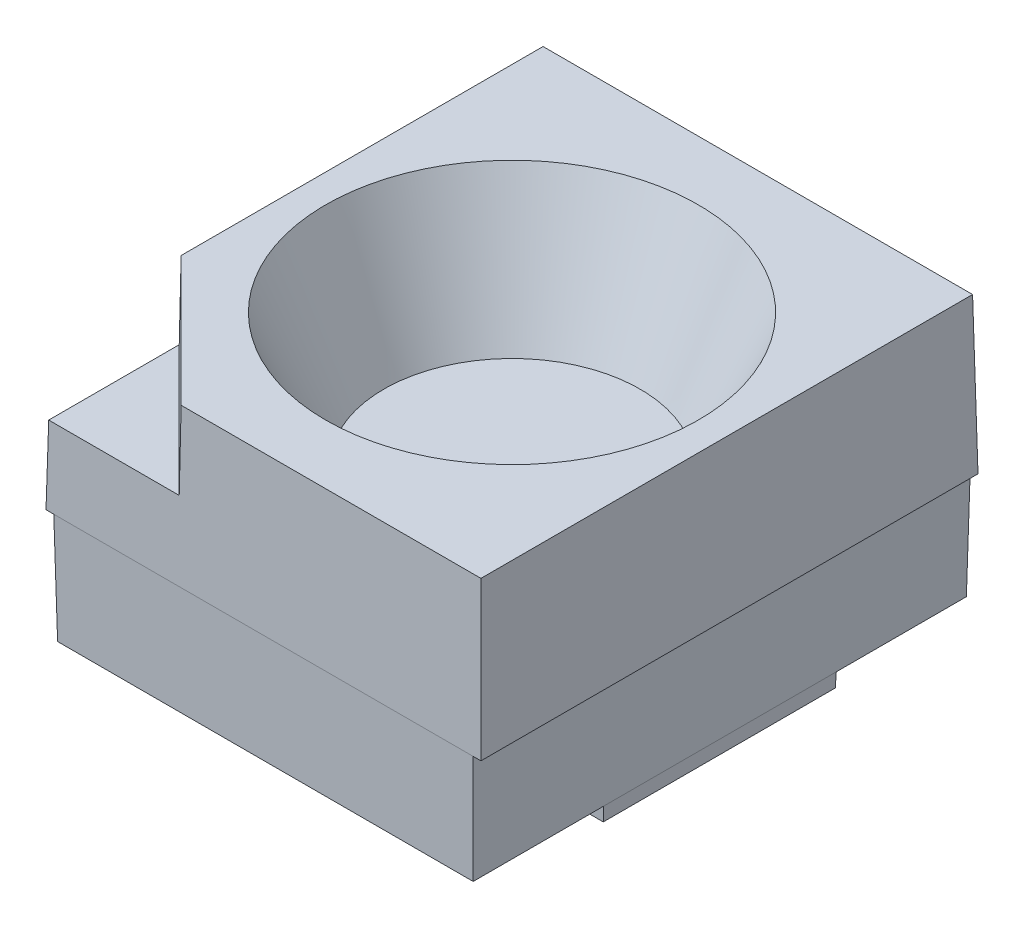
ISO-10303-21;
HEADER;
FILE_DESCRIPTION(('STEP AP214'),'2;1');
FILE_NAME('part.step','',(''),(''),'','','');
FILE_SCHEMA(('AUTOMOTIVE_DESIGN { 1 0 10303 214 1 1 1 1 }'));
ENDSEC;
DATA;
#1=APPLICATION_CONTEXT('core data for automotive mechanical design processes');
#2=APPLICATION_PROTOCOL_DEFINITION('international standard','automotive_design',2000,#1);
#3=PRODUCT_CONTEXT('',#1,'mechanical');
#4=PRODUCT('Part','Part','',(#3));
#5=PRODUCT_RELATED_PRODUCT_CATEGORY('part','',(#4));
#6=PRODUCT_DEFINITION_FORMATION('','',#4);
#7=PRODUCT_DEFINITION_CONTEXT('part definition',#1,'design');
#8=PRODUCT_DEFINITION('design','',#6,#7);
#9=PRODUCT_DEFINITION_SHAPE('','',#8);
#10=(LENGTH_UNIT() NAMED_UNIT(*) SI_UNIT(.MILLI.,.METRE.));
#11=(NAMED_UNIT(*) PLANE_ANGLE_UNIT() SI_UNIT($,.RADIAN.));
#12=(NAMED_UNIT(*) SI_UNIT($,.STERADIAN.) SOLID_ANGLE_UNIT());
#13=UNCERTAINTY_MEASURE_WITH_UNIT(LENGTH_MEASURE(1.E-05),#10,'distance_accuracy_value','');
#14=(GEOMETRIC_REPRESENTATION_CONTEXT(3) GLOBAL_UNCERTAINTY_ASSIGNED_CONTEXT((#13)) GLOBAL_UNIT_ASSIGNED_CONTEXT((#10,
#11,#12)) REPRESENTATION_CONTEXT('',''));
#15=CARTESIAN_POINT('',(0.,0.,0.));
#16=DIRECTION('',(0.,0.,1.));
#17=DIRECTION('',(1.,0.,0.));
#18=AXIS2_PLACEMENT_3D('',#15,#16,#17);
#19=CARTESIAN_POINT('',(0.,0.26,0.));
#20=DIRECTION('',(0.,1.,0.));
#21=DIRECTION('',(0.,0.,1.));
#22=AXIS2_PLACEMENT_3D('',#19,#20,#21);
#23=PLANE('',#22);
#24=CARTESIAN_POINT('',(0.,0.26,0.));
#25=DIRECTION('',(0.,1.,0.));
#26=DIRECTION('',(0.,0.,1.));
#27=AXIS2_PLACEMENT_3D('',#24,#25,#26);
#28=CIRCLE('',#27,0.5);
#29=CARTESIAN_POINT('',(0.,0.26,0.5));
#30=VERTEX_POINT('',#29);
#31=EDGE_CURVE('E20',#30,#30,#28,.F.);
#32=ORIENTED_EDGE('',*,*,#31,.T.);
#33=EDGE_LOOP('',(#32));
#34=FACE_BOUND('',#33,.T.);
#35=ADVANCED_FACE('F17',(#34),#23,.F.);
#36=CARTESIAN_POINT('',(0.,0.155,0.));
#37=DIRECTION('',(0.,1.,0.));
#38=DIRECTION('',(0.,0.,1.));
#39=AXIS2_PLACEMENT_3D('',#36,#37,#38);
#40=CYLINDRICAL_SURFACE('',#39,0.5);
#41=ORIENTED_EDGE('',*,*,#31,.F.);
#42=EDGE_LOOP('',(#41));
#43=FACE_BOUND('',#42,.T.);
#44=CARTESIAN_POINT('',(0.,0.06,0.));
#45=DIRECTION('',(0.,1.,0.));
#46=DIRECTION('',(0.,0.,1.));
#47=AXIS2_PLACEMENT_3D('',#44,#45,#46);
#48=CIRCLE('',#47,0.5);
#49=CARTESIAN_POINT('',(0.,0.0599999999999999,0.5));
#50=VERTEX_POINT('',#49);
#51=EDGE_CURVE('E148',#50,#50,#48,.F.);
#52=ORIENTED_EDGE('',*,*,#51,.T.);
#53=EDGE_LOOP('',(#52));
#54=FACE_BOUND('',#53,.T.);
#55=ADVANCED_FACE('F164',(#43,#54),#40,.F.);
#56=CARTESIAN_POINT('',(0.,0.06,0.));
#57=DIRECTION('',(0.,1.,0.));
#58=DIRECTION('',(0.,0.,1.));
#59=AXIS2_PLACEMENT_3D('',#56,#57,#58);
#60=PLANE('',#59);
#61=DIRECTION('',(1.,0.,0.));
#62=VECTOR('',#61,1.);
#63=CARTESIAN_POINT('',(-1.3376069,0.06,0.746857130745743));
#64=LINE('',#63,#62);
#65=CARTESIAN_POINT('',(-1.33446403074574,0.06,0.746857130745743));
#66=VERTEX_POINT('',#65);
#67=CARTESIAN_POINT('',(1.33446403074574,0.06,0.746857130745743));
#68=VERTEX_POINT('',#67);
#69=EDGE_CURVE('E123',#66,#68,#64,.T.);
#70=ORIENTED_EDGE('',*,*,#69,.F.);
#71=DIRECTION('',(0.,0.,1.));
#72=VECTOR('',#71,1.);
#73=CARTESIAN_POINT('',(-1.33446403074574,0.06,0.));
#74=LINE('',#73,#72);
#75=CARTESIAN_POINT('',(-1.33446403074574,0.06,-0.746857130745743));
#76=VERTEX_POINT('',#75);
#77=EDGE_CURVE('E135',#76,#66,#74,.T.);
#78=ORIENTED_EDGE('',*,*,#77,.F.);
#79=DIRECTION('',(1.,0.,0.));
#80=VECTOR('',#79,1.);
#81=CARTESIAN_POINT('',(1.3376069,0.06,-0.746857130745743));
#82=LINE('',#81,#80);
#83=CARTESIAN_POINT('',(1.33446403074574,0.06,-0.746857130745743));
#84=VERTEX_POINT('',#83);
#85=EDGE_CURVE('E116',#84,#76,#82,.F.);
#86=ORIENTED_EDGE('',*,*,#85,.F.);
#87=DIRECTION('',(0.,0.,1.));
#88=VECTOR('',#87,1.);
#89=CARTESIAN_POINT('',(1.33446403074574,0.0599999999999999,0.75));
#90=LINE('',#89,#88);
#91=EDGE_CURVE('E119',#68,#84,#90,.F.);
#92=ORIENTED_EDGE('',*,*,#91,.F.);
#93=EDGE_LOOP('',(#70,#78,#86,#92));
#94=FACE_BOUND('',#93,.T.);
#95=ORIENTED_EDGE('',*,*,#51,.F.);
#96=EDGE_LOOP('',(#95));
#97=FACE_BOUND('',#96,.T.);
#98=ADVANCED_FACE('F121',(#94,#97),#60,.F.);
#99=CARTESIAN_POINT('',(-1.3376069,0.15,0.75));
#100=DIRECTION('',(0.,-0.0348994967025014,0.999390827019096));
#101=DIRECTION('',(0.,-0.999390827019096,-0.0348994967025014));
#102=AXIS2_PLACEMENT_3D('',#99,#100,#101);
#103=PLANE('',#102);
#104=DIRECTION('',(1.,0.,0.));
#105=VECTOR('',#104,1.);
#106=CARTESIAN_POINT('',(0.,0.15,0.74999999999974));
#107=LINE('',#106,#105);
#108=CARTESIAN_POINT('',(1.33760690255998,0.149999999994684,0.749999999999554));
#109=VERTEX_POINT('',#108);
#110=CARTESIAN_POINT('',(-1.33760690099034,0.14999999999003,0.749999999999768));
#111=VERTEX_POINT('',#110);
#112=EDGE_CURVE('E429',#109,#111,#107,.F.);
#113=ORIENTED_EDGE('',*,*,#112,.T.);
#114=DIRECTION('',(-0.0348782627423816,0.998782765958977,0.034878262734965));
#115=VECTOR('',#114,1.);
#116=CARTESIAN_POINT('',(-1.33446403074574,0.0599999999999999,0.746857130745743));
#117=LINE('',#116,#115);
#118=EDGE_CURVE('E134',#66,#111,#117,.T.);
#119=ORIENTED_EDGE('',*,*,#118,.F.);
#120=ORIENTED_EDGE('',*,*,#69,.T.);
#121=DIRECTION('',(-0.0348782627424097,-0.998782765959737,-0.0348782627131562));
#122=VECTOR('',#121,1.);
#123=CARTESIAN_POINT('',(1.33760690000238,0.150000000068034,0.74999999999974));
#124=LINE('',#123,#122);
#125=EDGE_CURVE('E128',#109,#68,#124,.T.);
#126=ORIENTED_EDGE('',*,*,#125,.F.);
#127=EDGE_LOOP('',(#113,#119,#120,#126));
#128=FACE_BOUND('',#127,.T.);
#129=ADVANCED_FACE('F131',(#128),#103,.T.);
#130=CARTESIAN_POINT('',(1.3376069,0.15,0.75));
#131=DIRECTION('',(0.999390827019096,-0.0348994967025001,0.));
#132=DIRECTION('',(0.0348994967025001,0.999390827019096,0.));
#133=AXIS2_PLACEMENT_3D('',#130,#131,#132);
#134=PLANE('',#133);
#135=DIRECTION('',(0.,0.,1.));
#136=VECTOR('',#135,1.);
#137=CARTESIAN_POINT('',(1.3376069039003,0.149999999961715,1.6));
#138=LINE('',#137,#136);
#139=CARTESIAN_POINT('',(1.33760690089942,0.150000000005314,-0.749999999999787));
#140=VERTEX_POINT('',#139);
#141=EDGE_CURVE('E140',#109,#140,#138,.F.);
#142=ORIENTED_EDGE('',*,*,#141,.F.);
#143=ORIENTED_EDGE('',*,*,#125,.T.);
#144=ORIENTED_EDGE('',*,*,#91,.T.);
#145=DIRECTION('',(-0.0348782749061571,-0.998782765534467,0.0348782627275606));
#146=VECTOR('',#145,1.);
#147=CARTESIAN_POINT('',(1.33760690109711,0.149999999991498,-0.749999999999703));
#148=LINE('',#147,#146);
#149=EDGE_CURVE('E143',#140,#84,#148,.T.);
#150=ORIENTED_EDGE('',*,*,#149,.F.);
#151=EDGE_LOOP('',(#142,#143,#144,#150));
#152=FACE_BOUND('',#151,.T.);
#153=ADVANCED_FACE('F138',(#152),#134,.T.);
#154=CARTESIAN_POINT('',(1.3376069,0.15,-0.75));
#155=DIRECTION('',(0.,-0.0348994967025014,-0.999390827019096));
#156=DIRECTION('',(0.,0.999390827019096,-0.0348994967025014));
#157=AXIS2_PLACEMENT_3D('',#154,#155,#156);
#158=PLANE('',#157);
#159=DIRECTION('',(1.,0.,0.));
#160=VECTOR('',#159,1.);
#161=CARTESIAN_POINT('',(0.,0.15,-0.749999999999703));
#162=LINE('',#161,#160);
#163=CARTESIAN_POINT('',(-1.33760690255988,0.149999999992424,-0.749999999999466));
#164=VERTEX_POINT('',#163);
#165=EDGE_CURVE('E404',#164,#140,#162,.T.);
#166=ORIENTED_EDGE('',*,*,#165,.T.);
#167=ORIENTED_EDGE('',*,*,#149,.T.);
#168=ORIENTED_EDGE('',*,*,#85,.T.);
#169=DIRECTION('',(0.0348782627424078,-0.998782765959737,0.0348782627131579));
#170=VECTOR('',#169,1.);
#171=CARTESIAN_POINT('',(-1.33760690000234,0.150000000066971,-0.749999999999703));
#172=LINE('',#171,#170);
#173=EDGE_CURVE('E406',#164,#76,#172,.T.);
#174=ORIENTED_EDGE('',*,*,#173,.F.);
#175=EDGE_LOOP('',(#166,#167,#168,#174));
#176=FACE_BOUND('',#175,.T.);
#177=ADVANCED_FACE('F247',(#176),#158,.T.);
#178=CARTESIAN_POINT('',(-1.3376069,0.15,-0.75));
#179=DIRECTION('',(-0.999390827019096,-0.0348994967025001,0.));
#180=DIRECTION('',(0.0348994967025001,-0.999390827019096,0.));
#181=AXIS2_PLACEMENT_3D('',#178,#179,#180);
#182=PLANE('',#181);
#183=DIRECTION('',(0.,0.,1.));
#184=VECTOR('',#183,1.);
#185=CARTESIAN_POINT('',(-1.33760690390028,0.149999999960651,-1.6));
#186=LINE('',#185,#184);
#187=EDGE_CURVE('E433',#164,#111,#186,.T.);
#188=ORIENTED_EDGE('',*,*,#187,.F.);
#189=ORIENTED_EDGE('',*,*,#173,.T.);
#190=ORIENTED_EDGE('',*,*,#77,.T.);
#191=ORIENTED_EDGE('',*,*,#118,.T.);
#192=EDGE_LOOP('',(#188,#189,#190,#191));
#193=FACE_BOUND('',#192,.T.);
#194=ADVANCED_FACE('F243',(#193),#182,.T.);
#195=CARTESIAN_POINT('',(0.,0.15,0.));
#196=DIRECTION('',(0.,1.,0.));
#197=DIRECTION('',(0.,0.,1.));
#198=AXIS2_PLACEMENT_3D('',#195,#196,#197);
#199=PLANE('',#198);
#200=DIRECTION('',(0.,0.,1.));
#201=VECTOR('',#200,1.);
#202=CARTESIAN_POINT('',(-1.33760690389987,0.149999999937248,-1.6));
#203=LINE('',#202,#201);
#204=CARTESIAN_POINT('',(-1.33760690195,0.14999999997474,1.58760690390046));
#205=VERTEX_POINT('',#204);
#206=EDGE_CURVE('E419',#111,#205,#203,.T.);
#207=ORIENTED_EDGE('',*,*,#206,.F.);
#208=ORIENTED_EDGE('',*,*,#112,.F.);
#209=DIRECTION('',(0.,0.,1.));
#210=VECTOR('',#209,1.);
#211=CARTESIAN_POINT('',(1.33760690390089,0.149999999995746,1.6));
#212=LINE('',#211,#210);
#213=CARTESIAN_POINT('',(1.33760690390074,0.149999999989365,1.58760690390052));
#214=VERTEX_POINT('',#213);
#215=EDGE_CURVE('E415',#214,#109,#212,.F.);
#216=ORIENTED_EDGE('',*,*,#215,.F.);
#217=DIRECTION('',(1.,0.,0.));
#218=VECTOR('',#217,1.);
#219=CARTESIAN_POINT('',(-1.35,0.149999999961714,1.5876069039003));
#220=LINE('',#219,#218);
#221=EDGE_CURVE('E438',#205,#214,#220,.T.);
#222=ORIENTED_EDGE('',*,*,#221,.F.);
#223=EDGE_LOOP('',(#207,#208,#216,#222));
#224=FACE_BOUND('',#223,.T.);
#225=ADVANCED_FACE('F239',(#224),#199,.F.);
#226=CARTESIAN_POINT('',(1.35,0.86,1.6));
#227=DIRECTION('',(0.999847695156391,-0.0174524064372834,0.));
#228=DIRECTION('',(0.0174524064372834,0.999847695156391,0.));
#229=AXIS2_PLACEMENT_3D('',#226,#227,#228);
#230=PLANE('',#229);
#231=ORIENTED_EDGE('',*,*,#215,.T.);
#232=ORIENTED_EDGE('',*,*,#141,.T.);
#233=DIRECTION('',(0.,0.,1.));
#234=VECTOR('',#233,1.);
#235=CARTESIAN_POINT('',(1.33760690109711,0.15,0.));
#236=LINE('',#235,#234);
#237=CARTESIAN_POINT('',(1.33760690295549,0.149999999960648,-1.58760690390024));
#238=VERTEX_POINT('',#237);
#239=EDGE_CURVE('E409',#140,#238,#236,.F.);
#240=ORIENTED_EDGE('',*,*,#239,.T.);
#241=DIRECTION('',(0.0174497491606828,0.999695459881895,-0.0174497491602685));
#242=VECTOR('',#241,1.);
#243=CARTESIAN_POINT('',(1.33760690389993,0.149999999940437,-1.58760690390022));
#244=LINE('',#243,#242);
#245=CARTESIAN_POINT('',(1.35,0.86,-1.6));
#246=VERTEX_POINT('',#245);
#247=EDGE_CURVE('E427',#238,#246,#244,.T.);
#248=ORIENTED_EDGE('',*,*,#247,.T.);
#249=DIRECTION('',(0.,0.,1.));
#250=VECTOR('',#249,1.);
#251=CARTESIAN_POINT('',(1.35,0.86,0.));
#252=LINE('',#251,#250);
#253=CARTESIAN_POINT('',(1.35,0.86,1.6));
#254=VERTEX_POINT('',#253);
#255=EDGE_CURVE('E450',#246,#254,#252,.T.);
#256=ORIENTED_EDGE('',*,*,#255,.T.);
#257=DIRECTION('',(0.0174497491606842,0.999695459881887,0.0174497491606827));
#258=VECTOR('',#257,1.);
#259=CARTESIAN_POINT('',(1.33760690390089,0.149999999995743,1.58760690390089));
#260=LINE('',#259,#258);
#261=EDGE_CURVE('E441',#214,#254,#260,.T.);
#262=ORIENTED_EDGE('',*,*,#261,.F.);
#263=EDGE_LOOP('',(#231,#232,#240,#248,#256,#262));
#264=FACE_BOUND('',#263,.T.);
#265=ADVANCED_FACE('F235',(#264),#230,.T.);
#266=CARTESIAN_POINT('',(0.,0.15,0.));
#267=DIRECTION('',(0.,1.,0.));
#268=DIRECTION('',(0.,0.,1.));
#269=AXIS2_PLACEMENT_3D('',#266,#267,#268);
#270=PLANE('',#269);
#271=ORIENTED_EDGE('',*,*,#239,.F.);
#272=ORIENTED_EDGE('',*,*,#165,.F.);
#273=DIRECTION('',(0.,0.,1.));
#274=VECTOR('',#273,1.);
#275=CARTESIAN_POINT('',(-1.33760690390082,0.149999999991491,-1.6));
#276=LINE('',#275,#274);
#277=CARTESIAN_POINT('',(-1.33760690390067,0.149999999987237,-1.5876069039003));
#278=VERTEX_POINT('',#277);
#279=EDGE_CURVE('E422',#278,#164,#276,.T.);
#280=ORIENTED_EDGE('',*,*,#279,.F.);
#281=DIRECTION('',(1.,0.,0.));
#282=VECTOR('',#281,1.);
#283=CARTESIAN_POINT('',(1.35,0.149999999957456,-1.58760690390022));
#284=LINE('',#283,#282);
#285=EDGE_CURVE('E418',#238,#278,#284,.F.);
#286=ORIENTED_EDGE('',*,*,#285,.F.);
#287=EDGE_LOOP('',(#271,#272,#280,#286));
#288=FACE_BOUND('',#287,.T.);
#289=ADVANCED_FACE('F231',(#288),#270,.F.);
#290=CARTESIAN_POINT('',(-1.35,0.86,-1.6));
#291=DIRECTION('',(-0.999847695156391,-0.0174524064372834,0.));
#292=DIRECTION('',(0.0174524064372834,-0.999847695156391,0.));
#293=AXIS2_PLACEMENT_3D('',#290,#291,#292);
#294=PLANE('',#293);
#295=ORIENTED_EDGE('',*,*,#279,.T.);
#296=ORIENTED_EDGE('',*,*,#187,.T.);
#297=ORIENTED_EDGE('',*,*,#206,.T.);
#298=DIRECTION('',(0.0174497510482609,-0.99969545984895,-0.0174497491601077));
#299=VECTOR('',#298,1.);
#300=CARTESIAN_POINT('',(-1.35,0.86,1.6));
#301=LINE('',#300,#299);
#302=CARTESIAN_POINT('',(-1.35,0.86,1.6));
#303=VERTEX_POINT('',#302);
#304=EDGE_CURVE('E446',#303,#205,#301,.T.);
#305=ORIENTED_EDGE('',*,*,#304,.F.);
#306=DIRECTION('',(0.,0.,1.));
#307=VECTOR('',#306,1.);
#308=CARTESIAN_POINT('',(-1.35,0.86,0.));
#309=LINE('',#308,#307);
#310=CARTESIAN_POINT('',(-1.35,0.86,-1.6));
#311=VERTEX_POINT('',#310);
#312=EDGE_CURVE('E156',#303,#311,#309,.F.);
#313=ORIENTED_EDGE('',*,*,#312,.T.);
#314=DIRECTION('',(-0.0174497491606785,0.999695459881887,-0.0174497491606825));
#315=VECTOR('',#314,1.);
#316=CARTESIAN_POINT('',(-1.33760690390082,0.149999999991486,-1.58760690390082));
#317=LINE('',#316,#315);
#318=EDGE_CURVE('E453',#278,#311,#317,.T.);
#319=ORIENTED_EDGE('',*,*,#318,.F.);
#320=EDGE_LOOP('',(#295,#296,#297,#305,#313,#319));
#321=FACE_BOUND('',#320,.T.);
#322=ADVANCED_FACE('F227',(#321),#294,.T.);
#323=CARTESIAN_POINT('',(0.,1.02,0.));
#324=DIRECTION('',(0.,-1.,0.));
#325=DIRECTION('',(0.,0.,-1.));
#326=AXIS2_PLACEMENT_3D('',#323,#324,#325);
#327=PLANE('',#326);
#328=CARTESIAN_POINT('',(0.,1.0199999999827,0.));
#329=DIRECTION('',(0.,1.,0.));
#330=DIRECTION('',(0.,0.,1.));
#331=AXIS2_PLACEMENT_3D('',#328,#329,#330);
#332=CIRCLE('',#331,0.825000000014192);
#333=CARTESIAN_POINT('',(0.,1.0199999999827,0.825000000014192));
#334=VERTEX_POINT('',#333);
#335=EDGE_CURVE('E153',#334,#334,#332,.T.);
#336=ORIENTED_EDGE('',*,*,#335,.T.);
#337=EDGE_LOOP('',(#336));
#338=FACE_BOUND('',#337,.T.);
#339=ADVANCED_FACE('F223',(#338),#327,.F.);
#340=CARTESIAN_POINT('',(-1.35,0.86,1.6));
#341=DIRECTION('',(0.,-0.0174524064372834,0.999847695156391));
#342=DIRECTION('',(0.,-0.999847695156391,-0.0174524064372834));
#343=AXIS2_PLACEMENT_3D('',#340,#341,#342);
#344=PLANE('',#343);
#345=DIRECTION('',(1.,0.,0.));
#346=VECTOR('',#345,1.);
#347=CARTESIAN_POINT('',(1.4,0.86,1.6));
#348=LINE('',#347,#346);
#349=EDGE_CURVE('E155',#303,#254,#348,.T.);
#350=ORIENTED_EDGE('',*,*,#349,.F.);
#351=ORIENTED_EDGE('',*,*,#304,.T.);
#352=ORIENTED_EDGE('',*,*,#221,.T.);
#353=ORIENTED_EDGE('',*,*,#261,.T.);
#354=EDGE_LOOP('',(#350,#351,#352,#353));
#355=FACE_BOUND('',#354,.T.);
#356=ADVANCED_FACE('F219',(#355),#344,.T.);
#357=CARTESIAN_POINT('',(0.,0.86,0.));
#358=DIRECTION('',(0.,1.,0.));
#359=DIRECTION('',(0.,0.,1.));
#360=AXIS2_PLACEMENT_3D('',#357,#358,#359);
#361=PLANE('',#360);
#362=DIRECTION('',(1.,0.,0.));
#363=VECTOR('',#362,1.);
#364=CARTESIAN_POINT('',(1.4,0.86,1.6));
#365=LINE('',#364,#363);
#366=CARTESIAN_POINT('',(1.4,0.86,1.6));
#367=VERTEX_POINT('',#366);
#368=EDGE_CURVE('E459',#254,#367,#365,.T.);
#369=ORIENTED_EDGE('',*,*,#368,.F.);
#370=ORIENTED_EDGE('',*,*,#255,.F.);
#371=DIRECTION('',(1.,0.,0.));
#372=VECTOR('',#371,1.);
#373=CARTESIAN_POINT('',(0.,0.86,-1.6));
#374=LINE('',#373,#372);
#375=CARTESIAN_POINT('',(1.4,0.86,-1.6));
#376=VERTEX_POINT('',#375);
#377=EDGE_CURVE('E448',#376,#246,#374,.F.);
#378=ORIENTED_EDGE('',*,*,#377,.F.);
#379=DIRECTION('',(0.,0.,1.));
#380=VECTOR('',#379,1.);
#381=CARTESIAN_POINT('',(1.4,0.86,-1.6));
#382=LINE('',#381,#380);
#383=EDGE_CURVE('E469',#367,#376,#382,.F.);
#384=ORIENTED_EDGE('',*,*,#383,.F.);
#385=EDGE_LOOP('',(#369,#370,#378,#384));
#386=FACE_BOUND('',#385,.T.);
#387=ADVANCED_FACE('F215',(#386),#361,.F.);
#388=CARTESIAN_POINT('',(1.35,0.86,-1.6));
#389=DIRECTION('',(0.,-0.0174524064372834,-0.999847695156391));
#390=DIRECTION('',(0.,0.999847695156391,-0.0174524064372834));
#391=AXIS2_PLACEMENT_3D('',#388,#389,#390);
#392=PLANE('',#391);
#393=DIRECTION('',(1.,0.,0.));
#394=VECTOR('',#393,1.);
#395=CARTESIAN_POINT('',(-1.4,0.86,-1.6));
#396=LINE('',#395,#394);
#397=EDGE_CURVE('E472',#246,#311,#396,.F.);
#398=ORIENTED_EDGE('',*,*,#397,.F.);
#399=ORIENTED_EDGE('',*,*,#247,.F.);
#400=ORIENTED_EDGE('',*,*,#285,.T.);
#401=ORIENTED_EDGE('',*,*,#318,.T.);
#402=EDGE_LOOP('',(#398,#399,#400,#401));
#403=FACE_BOUND('',#402,.T.);
#404=ADVANCED_FACE('F211',(#403),#392,.T.);
#405=CARTESIAN_POINT('',(0.,0.86,0.));
#406=DIRECTION('',(0.,1.,0.));
#407=DIRECTION('',(0.,0.,1.));
#408=AXIS2_PLACEMENT_3D('',#405,#406,#407);
#409=PLANE('',#408);
#410=DIRECTION('',(1.,0.,0.));
#411=VECTOR('',#410,1.);
#412=CARTESIAN_POINT('',(-1.4,0.86,-1.6));
#413=LINE('',#412,#411);
#414=CARTESIAN_POINT('',(-1.4,0.86,-1.6));
#415=VERTEX_POINT('',#414);
#416=EDGE_CURVE('E475',#311,#415,#413,.F.);
#417=ORIENTED_EDGE('',*,*,#416,.F.);
#418=ORIENTED_EDGE('',*,*,#312,.F.);
#419=DIRECTION('',(1.,0.,0.));
#420=VECTOR('',#419,1.);
#421=CARTESIAN_POINT('',(1.4,0.86,1.6));
#422=LINE('',#421,#420);
#423=CARTESIAN_POINT('',(-1.4,0.86,1.6));
#424=VERTEX_POINT('',#423);
#425=EDGE_CURVE('E463',#424,#303,#422,.T.);
#426=ORIENTED_EDGE('',*,*,#425,.F.);
#427=DIRECTION('',(0.,0.,1.));
#428=VECTOR('',#427,1.);
#429=CARTESIAN_POINT('',(-1.4,0.86,1.6));
#430=LINE('',#429,#428);
#431=EDGE_CURVE('E483',#415,#424,#430,.T.);
#432=ORIENTED_EDGE('',*,*,#431,.F.);
#433=EDGE_LOOP('',(#417,#418,#426,#432));
#434=FACE_BOUND('',#433,.T.);
#435=ADVANCED_FACE('F207',(#434),#409,.F.);
#436=CARTESIAN_POINT('',(-1.09240855018385,1.36,1.29240855018385));
#437=DIRECTION('',(0.,1.,0.));
#438=DIRECTION('',(0.,0.,1.));
#439=AXIS2_PLACEMENT_3D('',#436,#437,#438);
#440=PLANE('',#439);
#441=DIRECTION('',(1.,0.,0.));
#442=VECTOR('',#441,1.);
#443=CARTESIAN_POINT('',(1.4,1.36,1.59127246753589));
#444=LINE('',#443,#442);
#445=CARTESIAN_POINT('',(-0.551070127240903,1.36,1.59127246753589));
#446=VERTEX_POINT('',#445);
#447=CARTESIAN_POINT('',(-1.39127246753589,1.36,1.59127246753589));
#448=VERTEX_POINT('',#447);
#449=EDGE_CURVE('E461',#446,#448,#444,.F.);
#450=ORIENTED_EDGE('',*,*,#449,.F.);
#451=DIRECTION('',(-0.707106781186548,0.,-0.707106781186548));
#452=VECTOR('',#451,1.);
#453=CARTESIAN_POINT('',(-0.536171297388397,1.36,1.6061712973884));
#454=LINE('',#453,#452);
#455=CARTESIAN_POINT('',(-1.39127246753589,1.36,0.751070127240903));
#456=VERTEX_POINT('',#455);
#457=EDGE_CURVE('E494',#446,#456,#454,.T.);
#458=ORIENTED_EDGE('',*,*,#457,.T.);
#459=DIRECTION('',(0.,0.,1.));
#460=VECTOR('',#459,1.);
#461=CARTESIAN_POINT('',(-1.39127246753589,1.36,1.6));
#462=LINE('',#461,#460);
#463=EDGE_CURVE('E489',#448,#456,#462,.F.);
#464=ORIENTED_EDGE('',*,*,#463,.F.);
#465=EDGE_LOOP('',(#450,#458,#464));
#466=FACE_BOUND('',#465,.T.);
#467=ADVANCED_FACE('F203',(#466),#440,.T.);
#468=CARTESIAN_POINT('',(0.,1.85999999990827,0.));
#469=DIRECTION('',(0.,1.,0.));
#470=DIRECTION('',(0.,0.,1.));
#471=AXIS2_PLACEMENT_3D('',#468,#469,#470);
#472=CONICAL_SURFACE('',#471,1.19999999992615,0.419879957151141);
#473=ORIENTED_EDGE('',*,*,#335,.F.);
#474=EDGE_LOOP('',(#473));
#475=FACE_BOUND('',#474,.T.);
#476=CARTESIAN_POINT('',(0.,1.85999999996511,0.));
#477=DIRECTION('',(0.,1.,0.));
#478=DIRECTION('',(0.,0.,1.));
#479=AXIS2_PLACEMENT_3D('',#476,#477,#478);
#480=CIRCLE('',#479,1.19999999995153);
#481=CARTESIAN_POINT('',(0.,1.85999999996511,1.19999999995153));
#482=VERTEX_POINT('',#481);
#483=EDGE_CURVE('E149',#482,#482,#480,.F.);
#484=ORIENTED_EDGE('',*,*,#483,.F.);
#485=EDGE_LOOP('',(#484));
#486=FACE_BOUND('',#485,.T.);
#487=ADVANCED_FACE('F199',(#475,#486),#472,.F.);
#488=CARTESIAN_POINT('',(1.4,0.86,1.6));
#489=DIRECTION('',(0.,0.0174524064372836,0.999847695156391));
#490=DIRECTION('',(0.,-0.999847695156391,0.0174524064372836));
#491=AXIS2_PLACEMENT_3D('',#488,#489,#490);
#492=PLANE('',#491);
#493=DIRECTION('',(0.0174497491606828,0.999695459881888,-0.017449749160685));
#494=VECTOR('',#493,1.);
#495=CARTESIAN_POINT('',(-1.4,0.86,1.6));
#496=LINE('',#495,#494);
#497=EDGE_CURVE('E486',#424,#448,#496,.T.);
#498=ORIENTED_EDGE('',*,*,#497,.F.);
#499=ORIENTED_EDGE('',*,*,#425,.T.);
#500=ORIENTED_EDGE('',*,*,#349,.T.);
#501=ORIENTED_EDGE('',*,*,#368,.T.);
#502=DIRECTION('',(0.0174497491606828,-0.999695459881888,0.017449749160685));
#503=VECTOR('',#502,1.);
#504=CARTESIAN_POINT('',(1.38254493507178,1.86,1.58254493507178));
#505=LINE('',#504,#503);
#506=CARTESIAN_POINT('',(1.38254493507178,1.86,1.58254493507178));
#507=VERTEX_POINT('',#506);
#508=EDGE_CURVE('E466',#507,#367,#505,.T.);
#509=ORIENTED_EDGE('',*,*,#508,.F.);
#510=DIRECTION('',(1.,0.,0.));
#511=VECTOR('',#510,1.);
#512=CARTESIAN_POINT('',(0.,1.86,1.58254493507178));
#513=LINE('',#512,#511);
#514=CARTESIAN_POINT('',(-0.547455064928219,1.86,1.58254493507178));
#515=VERTEX_POINT('',#514);
#516=EDGE_CURVE('E152',#515,#507,#513,.T.);
#517=ORIENTED_EDGE('',*,*,#516,.F.);
#518=DIRECTION('',(-0.00722883455979808,-0.999821570769976,0.0174519504344252));
#519=VECTOR('',#518,1.);
#520=CARTESIAN_POINT('',(-0.54745506492822,1.86,1.58254493507178));
#521=LINE('',#520,#519);
#522=EDGE_CURVE('E491',#515,#446,#521,.T.);
#523=ORIENTED_EDGE('',*,*,#522,.T.);
#524=ORIENTED_EDGE('',*,*,#449,.T.);
#525=EDGE_LOOP('',(#498,#499,#500,#501,#509,#517,#523,#524));
#526=FACE_BOUND('',#525,.T.);
#527=ADVANCED_FACE('F195',(#526),#492,.T.);
#528=CARTESIAN_POINT('',(1.4,0.86,-1.6));
#529=DIRECTION('',(0.999847695156391,0.0174524064372836,0.));
#530=DIRECTION('',(-0.0174524064372836,0.999847695156391,0.));
#531=AXIS2_PLACEMENT_3D('',#528,#529,#530);
#532=PLANE('',#531);
#533=ORIENTED_EDGE('',*,*,#383,.T.);
#534=DIRECTION('',(0.017449749160685,-0.999695459881888,-0.0174497491606828));
#535=VECTOR('',#534,1.);
#536=CARTESIAN_POINT('',(1.38254493507178,1.86,-1.58254493507178));
#537=LINE('',#536,#535);
#538=CARTESIAN_POINT('',(1.38254493507178,1.86,-1.58254493507178));
#539=VERTEX_POINT('',#538);
#540=EDGE_CURVE('E477',#539,#376,#537,.T.);
#541=ORIENTED_EDGE('',*,*,#540,.F.);
#542=DIRECTION('',(0.,0.,1.));
#543=VECTOR('',#542,1.);
#544=CARTESIAN_POINT('',(1.38254493507178,1.86,0.));
#545=LINE('',#544,#543);
#546=EDGE_CURVE('E499',#507,#539,#545,.F.);
#547=ORIENTED_EDGE('',*,*,#546,.F.);
#548=ORIENTED_EDGE('',*,*,#508,.T.);
#549=EDGE_LOOP('',(#533,#541,#547,#548));
#550=FACE_BOUND('',#549,.T.);
#551=ADVANCED_FACE('F191',(#550),#532,.T.);
#552=CARTESIAN_POINT('',(-1.4,0.86,-1.6));
#553=DIRECTION('',(0.,0.0174524064372836,-0.999847695156391));
#554=DIRECTION('',(0.,0.999847695156391,0.0174524064372836));
#555=AXIS2_PLACEMENT_3D('',#552,#553,#554);
#556=PLANE('',#555);
#557=DIRECTION('',(1.,0.,0.));
#558=VECTOR('',#557,1.);
#559=CARTESIAN_POINT('',(0.,1.86,-1.58254493507178));
#560=LINE('',#559,#558);
#561=CARTESIAN_POINT('',(-1.38254493507178,1.86,-1.58254493507178));
#562=VERTEX_POINT('',#561);
#563=EDGE_CURVE('E502',#539,#562,#560,.F.);
#564=ORIENTED_EDGE('',*,*,#563,.F.);
#565=ORIENTED_EDGE('',*,*,#540,.T.);
#566=ORIENTED_EDGE('',*,*,#377,.T.);
#567=ORIENTED_EDGE('',*,*,#397,.T.);
#568=ORIENTED_EDGE('',*,*,#416,.T.);
#569=DIRECTION('',(-0.0174497491606828,-0.999695459881888,-0.017449749160685));
#570=VECTOR('',#569,1.);
#571=CARTESIAN_POINT('',(-1.38254493507178,1.86,-1.58254493507178));
#572=LINE('',#571,#570);
#573=EDGE_CURVE('E480',#562,#415,#572,.T.);
#574=ORIENTED_EDGE('',*,*,#573,.F.);
#575=EDGE_LOOP('',(#564,#565,#566,#567,#568,#574));
#576=FACE_BOUND('',#575,.T.);
#577=ADVANCED_FACE('F188',(#576),#556,.T.);
#578=CARTESIAN_POINT('',(-1.4,0.86,1.6));
#579=DIRECTION('',(-0.999847695156391,0.0174524064372836,0.));
#580=DIRECTION('',(-0.0174524064372836,-0.999847695156391,0.));
#581=AXIS2_PLACEMENT_3D('',#578,#579,#580);
#582=PLANE('',#581);
#583=ORIENTED_EDGE('',*,*,#463,.T.);
#584=DIRECTION('',(0.0174519504344234,0.999821570769976,-0.00722883455979981));
#585=VECTOR('',#584,1.);
#586=CARTESIAN_POINT('',(-1.39127246753589,1.36,0.751070127240903));
#587=LINE('',#586,#585);
#588=CARTESIAN_POINT('',(-1.38254493507178,1.86,0.747455064928218));
#589=VERTEX_POINT('',#588);
#590=EDGE_CURVE('E35',#456,#589,#587,.T.);
#591=ORIENTED_EDGE('',*,*,#590,.T.);
#592=DIRECTION('',(0.,0.,1.));
#593=VECTOR('',#592,1.);
#594=CARTESIAN_POINT('',(-1.38254493507178,1.86,0.));
#595=LINE('',#594,#593);
#596=EDGE_CURVE('E26',#562,#589,#595,.T.);
#597=ORIENTED_EDGE('',*,*,#596,.F.);
#598=ORIENTED_EDGE('',*,*,#573,.T.);
#599=ORIENTED_EDGE('',*,*,#431,.T.);
#600=ORIENTED_EDGE('',*,*,#497,.T.);
#601=EDGE_LOOP('',(#583,#591,#597,#598,#599,#600));
#602=FACE_BOUND('',#601,.T.);
#603=ADVANCED_FACE('F180',(#602),#582,.T.);
#604=CARTESIAN_POINT('',(-0.53,1.86,1.6));
#605=DIRECTION('',(0.706999085398824,-0.0174524064372835,-0.706999085398824));
#606=DIRECTION('',(-0.707106781186548,0.,-0.707106781186548));
#607=AXIS2_PLACEMENT_3D('',#604,#605,#606);
#608=PLANE('',#607);
#609=ORIENTED_EDGE('',*,*,#457,.F.);
#610=ORIENTED_EDGE('',*,*,#522,.F.);
#611=DIRECTION('',(0.707106781186547,0.,0.707106781186548));
#612=VECTOR('',#611,1.);
#613=CARTESIAN_POINT('',(-1.38254493507178,1.86,0.747455064928218));
#614=LINE('',#613,#612);
#615=EDGE_CURVE('E11',#589,#515,#614,.T.);
#616=ORIENTED_EDGE('',*,*,#615,.F.);
#617=ORIENTED_EDGE('',*,*,#590,.F.);
#618=EDGE_LOOP('',(#609,#610,#616,#617));
#619=FACE_BOUND('',#618,.T.);
#620=ADVANCED_FACE('F174',(#619),#608,.F.);
#621=CARTESIAN_POINT('',(0.,1.86,0.));
#622=DIRECTION('',(0.,1.,0.));
#623=DIRECTION('',(0.,0.,1.));
#624=AXIS2_PLACEMENT_3D('',#621,#622,#623);
#625=PLANE('',#624);
#626=ORIENTED_EDGE('',*,*,#596,.T.);
#627=ORIENTED_EDGE('',*,*,#615,.T.);
#628=ORIENTED_EDGE('',*,*,#516,.T.);
#629=ORIENTED_EDGE('',*,*,#546,.T.);
#630=ORIENTED_EDGE('',*,*,#563,.T.);
#631=EDGE_LOOP('',(#626,#627,#628,#629,#630));
#632=FACE_BOUND('',#631,.T.);
#633=ORIENTED_EDGE('',*,*,#483,.T.);
#634=EDGE_LOOP('',(#633));
#635=FACE_BOUND('',#634,.T.);
#636=ADVANCED_FACE('F172',(#632,#635),#625,.T.);
#637=CLOSED_SHELL('',(#35,#55,#98,#129,#153,#177,#194,#225,#265,#289,#322,#339,#356,#387,#404,
#435,#467,#487,#527,#551,#577,#603,#620,#636));
#638=MANIFOLD_SOLID_BREP('B1',#637);
#639=ADVANCED_BREP_SHAPE_REPRESENTATION('',(#18,#638),#14);
#640=SHAPE_DEFINITION_REPRESENTATION(#9,#639);
ENDSEC;
END-ISO-10303-21;
